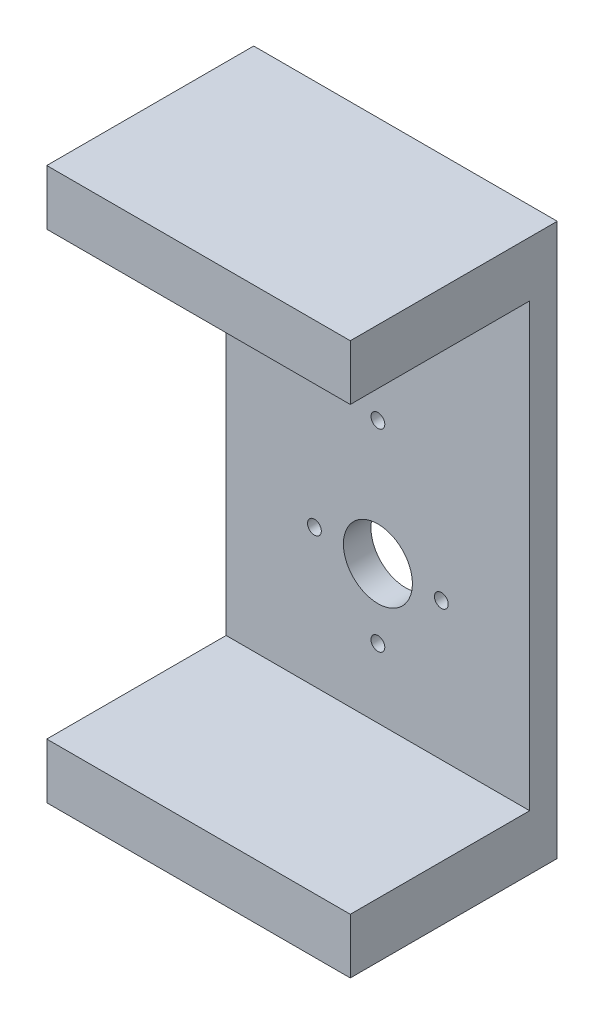
ISO-10303-21;
HEADER;
FILE_DESCRIPTION(('STEP AP214'),'2;1');
FILE_NAME('part.step','',(''),(''),'','','');
FILE_SCHEMA(('AUTOMOTIVE_DESIGN { 1 0 10303 214 1 1 1 1 }'));
ENDSEC;
DATA;
#1=APPLICATION_CONTEXT('core data for automotive mechanical design processes');
#2=APPLICATION_PROTOCOL_DEFINITION('international standard','automotive_design',2000,#1);
#3=PRODUCT_CONTEXT('',#1,'mechanical');
#4=PRODUCT('Part','Part','',(#3));
#5=PRODUCT_RELATED_PRODUCT_CATEGORY('part','',(#4));
#6=PRODUCT_DEFINITION_FORMATION('','',#4);
#7=PRODUCT_DEFINITION_CONTEXT('part definition',#1,'design');
#8=PRODUCT_DEFINITION('design','',#6,#7);
#9=PRODUCT_DEFINITION_SHAPE('','',#8);
#10=(LENGTH_UNIT() NAMED_UNIT(*) SI_UNIT(.MILLI.,.METRE.));
#11=(NAMED_UNIT(*) PLANE_ANGLE_UNIT() SI_UNIT($,.RADIAN.));
#12=(NAMED_UNIT(*) SI_UNIT($,.STERADIAN.) SOLID_ANGLE_UNIT());
#13=UNCERTAINTY_MEASURE_WITH_UNIT(LENGTH_MEASURE(1.E-05),#10,'distance_accuracy_value','');
#14=(GEOMETRIC_REPRESENTATION_CONTEXT(3) GLOBAL_UNCERTAINTY_ASSIGNED_CONTEXT((#13)) GLOBAL_UNIT_ASSIGNED_CONTEXT((#10,
#11,#12)) REPRESENTATION_CONTEXT('',''));
#15=CARTESIAN_POINT('',(0.,0.,0.));
#16=DIRECTION('',(0.,0.,1.));
#17=DIRECTION('',(1.,0.,0.));
#18=AXIS2_PLACEMENT_3D('',#15,#16,#17);
#19=CARTESIAN_POINT('',(0.,0.,10.));
#20=DIRECTION('',(0.,0.,-1.));
#21=DIRECTION('',(-1.,0.,0.));
#22=AXIS2_PLACEMENT_3D('',#19,#20,#21);
#23=PLANE('',#22);
#24=CARTESIAN_POINT('',(0.,15.,9.99999999999999));
#25=DIRECTION('',(0.,0.,-1.));
#26=DIRECTION('',(-1.,0.,0.));
#27=AXIS2_PLACEMENT_3D('',#24,#25,#26);
#28=CIRCLE('',#27,2.5);
#29=CARTESIAN_POINT('',(-2.5,15.,9.99999999999999));
#30=VERTEX_POINT('',#29);
#31=EDGE_CURVE('E337',#30,#30,#28,.T.);
#32=ORIENTED_EDGE('',*,*,#31,.T.);
#33=EDGE_LOOP('',(#32));
#34=FACE_BOUND('',#33,.T.);
#35=CARTESIAN_POINT('',(0.,-55.,9.99999999999999));
#36=DIRECTION('',(0.,0.,-1.));
#37=DIRECTION('',(-1.,0.,0.));
#38=AXIS2_PLACEMENT_3D('',#35,#36,#37);
#39=CIRCLE('',#38,2.5);
#40=CARTESIAN_POINT('',(-2.5,-55.,9.99999999999999));
#41=VERTEX_POINT('',#40);
#42=EDGE_CURVE('E340',#41,#41,#39,.T.);
#43=ORIENTED_EDGE('',*,*,#42,.T.);
#44=EDGE_LOOP('',(#43));
#45=FACE_BOUND('',#44,.T.);
#46=CARTESIAN_POINT('',(23.,-30.,9.99999999999999));
#47=DIRECTION('',(0.,0.,-1.));
#48=DIRECTION('',(-1.,0.,0.));
#49=AXIS2_PLACEMENT_3D('',#46,#47,#48);
#50=CIRCLE('',#49,2.5);
#51=CARTESIAN_POINT('',(20.5,-30.,9.99999999999999));
#52=VERTEX_POINT('',#51);
#53=EDGE_CURVE('E358',#52,#52,#50,.T.);
#54=ORIENTED_EDGE('',*,*,#53,.T.);
#55=EDGE_LOOP('',(#54));
#56=FACE_BOUND('',#55,.T.);
#57=CARTESIAN_POINT('',(-23.,-30.,9.99999999999999));
#58=DIRECTION('',(0.,0.,-1.));
#59=DIRECTION('',(-1.,0.,0.));
#60=AXIS2_PLACEMENT_3D('',#57,#58,#59);
#61=CIRCLE('',#60,2.5);
#62=CARTESIAN_POINT('',(-25.5,-30.,9.99999999999999));
#63=VERTEX_POINT('',#62);
#64=EDGE_CURVE('E353',#63,#63,#61,.T.);
#65=ORIENTED_EDGE('',*,*,#64,.T.);
#66=EDGE_LOOP('',(#65));
#67=FACE_BOUND('',#66,.T.);
#68=CARTESIAN_POINT('',(0.,-30.,9.99999999999999));
#69=DIRECTION('',(0.,0.,-1.));
#70=DIRECTION('',(-1.,0.,0.));
#71=AXIS2_PLACEMENT_3D('',#68,#69,#70);
#72=CIRCLE('',#71,12.5);
#73=CARTESIAN_POINT('',(-12.5,-30.,9.99999999999999));
#74=VERTEX_POINT('',#73);
#75=EDGE_CURVE('E150',#74,#74,#72,.T.);
#76=ORIENTED_EDGE('',*,*,#75,.T.);
#77=EDGE_LOOP('',(#76));
#78=FACE_BOUND('',#77,.T.);
#79=DIRECTION('',(1.,0.,0.));
#80=VECTOR('',#79,1.);
#81=CARTESIAN_POINT('',(-55.,80.,10.));
#82=LINE('',#81,#80);
#83=CARTESIAN_POINT('',(-55.,80.,10.));
#84=VERTEX_POINT('',#83);
#85=CARTESIAN_POINT('',(55.,80.,10.));
#86=VERTEX_POINT('',#85);
#87=EDGE_CURVE('E65',#84,#86,#82,.T.);
#88=ORIENTED_EDGE('',*,*,#87,.F.);
#89=DIRECTION('',(0.,-1.,0.));
#90=VECTOR('',#89,1.);
#91=CARTESIAN_POINT('',(-55.,-100.,10.));
#92=LINE('',#91,#90);
#93=CARTESIAN_POINT('',(-55.,-80.,10.));
#94=VERTEX_POINT('',#93);
#95=EDGE_CURVE('E133',#84,#94,#92,.T.);
#96=ORIENTED_EDGE('',*,*,#95,.T.);
#97=DIRECTION('',(-1.,0.,0.));
#98=VECTOR('',#97,1.);
#99=CARTESIAN_POINT('',(-55.,-80.,10.));
#100=LINE('',#99,#98);
#101=CARTESIAN_POINT('',(55.,-80.,10.));
#102=VERTEX_POINT('',#101);
#103=EDGE_CURVE('E60',#102,#94,#100,.T.);
#104=ORIENTED_EDGE('',*,*,#103,.F.);
#105=DIRECTION('',(0.,1.,0.));
#106=VECTOR('',#105,1.);
#107=CARTESIAN_POINT('',(55.,-100.,10.));
#108=LINE('',#107,#106);
#109=EDGE_CURVE('E171',#102,#86,#108,.T.);
#110=ORIENTED_EDGE('',*,*,#109,.T.);
#111=EDGE_LOOP('',(#88,#96,#104,#110));
#112=FACE_BOUND('',#111,.T.);
#113=ADVANCED_FACE('F44',(#34,#45,#56,#67,#78,#112),#23,.F.);
#114=CARTESIAN_POINT('',(55.,100.,10.));
#115=DIRECTION('',(0.,-1.,0.));
#116=DIRECTION('',(0.,0.,-1.));
#117=AXIS2_PLACEMENT_3D('',#114,#115,#116);
#118=PLANE('',#117);
#119=DIRECTION('',(-1.,0.,0.));
#120=VECTOR('',#119,1.);
#121=CARTESIAN_POINT('',(55.,100.,0.));
#122=LINE('',#121,#120);
#123=CARTESIAN_POINT('',(55.,100.,0.));
#124=VERTEX_POINT('',#123);
#125=CARTESIAN_POINT('',(-55.,100.,0.));
#126=VERTEX_POINT('',#125);
#127=EDGE_CURVE('E135',#124,#126,#122,.T.);
#128=ORIENTED_EDGE('',*,*,#127,.T.);
#129=DIRECTION('',(0.,0.,-1.));
#130=VECTOR('',#129,1.);
#131=CARTESIAN_POINT('',(-55.,100.,10.));
#132=LINE('',#131,#130);
#133=CARTESIAN_POINT('',(-55.,100.,75.));
#134=VERTEX_POINT('',#133);
#135=EDGE_CURVE('E11',#134,#126,#132,.T.);
#136=ORIENTED_EDGE('',*,*,#135,.F.);
#137=DIRECTION('',(-1.,0.,0.));
#138=VECTOR('',#137,1.);
#139=CARTESIAN_POINT('',(-55.,100.,75.));
#140=LINE('',#139,#138);
#141=CARTESIAN_POINT('',(55.,100.,75.));
#142=VERTEX_POINT('',#141);
#143=EDGE_CURVE('E127',#142,#134,#140,.T.);
#144=ORIENTED_EDGE('',*,*,#143,.F.);
#145=DIRECTION('',(0.,0.,-1.));
#146=VECTOR('',#145,1.);
#147=CARTESIAN_POINT('',(55.,100.,10.));
#148=LINE('',#147,#146);
#149=EDGE_CURVE('E174',#142,#124,#148,.T.);
#150=ORIENTED_EDGE('',*,*,#149,.T.);
#151=EDGE_LOOP('',(#128,#136,#144,#150));
#152=FACE_BOUND('',#151,.T.);
#153=ADVANCED_FACE('F46',(#152),#118,.F.);
#154=CARTESIAN_POINT('',(-55.,-100.,10.));
#155=DIRECTION('',(1.,0.,0.));
#156=DIRECTION('',(0.,0.,-1.));
#157=AXIS2_PLACEMENT_3D('',#154,#155,#156);
#158=PLANE('',#157);
#159=DIRECTION('',(0.,-1.,0.));
#160=VECTOR('',#159,1.);
#161=CARTESIAN_POINT('',(-55.,-100.,0.));
#162=LINE('',#161,#160);
#163=CARTESIAN_POINT('',(-55.,-100.,0.));
#164=VERTEX_POINT('',#163);
#165=EDGE_CURVE('E140',#126,#164,#162,.T.);
#166=ORIENTED_EDGE('',*,*,#165,.T.);
#167=DIRECTION('',(0.,0.,-1.));
#168=VECTOR('',#167,1.);
#169=CARTESIAN_POINT('',(-55.,-100.,10.));
#170=LINE('',#169,#168);
#171=CARTESIAN_POINT('',(-55.,-100.,75.));
#172=VERTEX_POINT('',#171);
#173=EDGE_CURVE('E53',#172,#164,#170,.T.);
#174=ORIENTED_EDGE('',*,*,#173,.F.);
#175=DIRECTION('',(0.,-1.,0.));
#176=VECTOR('',#175,1.);
#177=CARTESIAN_POINT('',(-55.,-100.,75.));
#178=LINE('',#177,#176);
#179=CARTESIAN_POINT('',(-55.,-80.,75.));
#180=VERTEX_POINT('',#179);
#181=EDGE_CURVE('E153',#180,#172,#178,.T.);
#182=ORIENTED_EDGE('',*,*,#181,.F.);
#183=DIRECTION('',(0.,0.,-1.));
#184=VECTOR('',#183,1.);
#185=CARTESIAN_POINT('',(-55.,-80.,75.));
#186=LINE('',#185,#184);
#187=EDGE_CURVE('E149',#180,#94,#186,.T.);
#188=ORIENTED_EDGE('',*,*,#187,.T.);
#189=ORIENTED_EDGE('',*,*,#95,.F.);
#190=DIRECTION('',(0.,0.,-1.));
#191=VECTOR('',#190,1.);
#192=CARTESIAN_POINT('',(-55.,80.,75.));
#193=LINE('',#192,#191);
#194=CARTESIAN_POINT('',(-55.,80.,75.));
#195=VERTEX_POINT('',#194);
#196=EDGE_CURVE('E113',#195,#84,#193,.T.);
#197=ORIENTED_EDGE('',*,*,#196,.F.);
#198=DIRECTION('',(0.,-1.,0.));
#199=VECTOR('',#198,1.);
#200=CARTESIAN_POINT('',(-55.,100.,75.));
#201=LINE('',#200,#199);
#202=EDGE_CURVE('E121',#134,#195,#201,.T.);
#203=ORIENTED_EDGE('',*,*,#202,.F.);
#204=ORIENTED_EDGE('',*,*,#135,.T.);
#205=EDGE_LOOP('',(#166,#174,#182,#188,#189,#197,#203,#204));
#206=FACE_BOUND('',#205,.T.);
#207=ADVANCED_FACE('F131',(#206),#158,.F.);
#208=CARTESIAN_POINT('',(55.,-100.,10.));
#209=DIRECTION('',(0.,1.,0.));
#210=DIRECTION('',(0.,0.,1.));
#211=AXIS2_PLACEMENT_3D('',#208,#209,#210);
#212=PLANE('',#211);
#213=DIRECTION('',(1.,0.,0.));
#214=VECTOR('',#213,1.);
#215=CARTESIAN_POINT('',(55.,-100.,0.));
#216=LINE('',#215,#214);
#217=CARTESIAN_POINT('',(55.,-100.,0.));
#218=VERTEX_POINT('',#217);
#219=EDGE_CURVE('E178',#164,#218,#216,.T.);
#220=ORIENTED_EDGE('',*,*,#219,.T.);
#221=DIRECTION('',(0.,0.,-1.));
#222=VECTOR('',#221,1.);
#223=CARTESIAN_POINT('',(55.,-100.,10.));
#224=LINE('',#223,#222);
#225=CARTESIAN_POINT('',(55.,-100.,75.));
#226=VERTEX_POINT('',#225);
#227=EDGE_CURVE('E186',#226,#218,#224,.T.);
#228=ORIENTED_EDGE('',*,*,#227,.F.);
#229=DIRECTION('',(1.,0.,0.));
#230=VECTOR('',#229,1.);
#231=CARTESIAN_POINT('',(-55.,-100.,75.));
#232=LINE('',#231,#230);
#233=EDGE_CURVE('E156',#172,#226,#232,.T.);
#234=ORIENTED_EDGE('',*,*,#233,.F.);
#235=ORIENTED_EDGE('',*,*,#173,.T.);
#236=EDGE_LOOP('',(#220,#228,#234,#235));
#237=FACE_BOUND('',#236,.T.);
#238=ADVANCED_FACE('F194',(#237),#212,.F.);
#239=CARTESIAN_POINT('',(55.,-100.,10.));
#240=DIRECTION('',(-1.,0.,0.));
#241=DIRECTION('',(0.,0.,1.));
#242=AXIS2_PLACEMENT_3D('',#239,#240,#241);
#243=PLANE('',#242);
#244=DIRECTION('',(0.,1.,0.));
#245=VECTOR('',#244,1.);
#246=CARTESIAN_POINT('',(55.,-100.,0.));
#247=LINE('',#246,#245);
#248=EDGE_CURVE('E172',#218,#124,#247,.T.);
#249=ORIENTED_EDGE('',*,*,#248,.T.);
#250=ORIENTED_EDGE('',*,*,#149,.F.);
#251=DIRECTION('',(0.,1.,0.));
#252=VECTOR('',#251,1.);
#253=CARTESIAN_POINT('',(55.,100.,75.));
#254=LINE('',#253,#252);
#255=CARTESIAN_POINT('',(55.,80.,75.));
#256=VERTEX_POINT('',#255);
#257=EDGE_CURVE('E120',#256,#142,#254,.T.);
#258=ORIENTED_EDGE('',*,*,#257,.F.);
#259=DIRECTION('',(0.,0.,-1.));
#260=VECTOR('',#259,1.);
#261=CARTESIAN_POINT('',(55.,80.,75.));
#262=LINE('',#261,#260);
#263=EDGE_CURVE('E115',#256,#86,#262,.T.);
#264=ORIENTED_EDGE('',*,*,#263,.T.);
#265=ORIENTED_EDGE('',*,*,#109,.F.);
#266=DIRECTION('',(0.,0.,-1.));
#267=VECTOR('',#266,1.);
#268=CARTESIAN_POINT('',(55.,-80.,75.));
#269=LINE('',#268,#267);
#270=CARTESIAN_POINT('',(55.,-80.,75.));
#271=VERTEX_POINT('',#270);
#272=EDGE_CURVE('E145',#271,#102,#269,.T.);
#273=ORIENTED_EDGE('',*,*,#272,.F.);
#274=DIRECTION('',(0.,1.,0.));
#275=VECTOR('',#274,1.);
#276=CARTESIAN_POINT('',(55.,-100.,75.));
#277=LINE('',#276,#275);
#278=EDGE_CURVE('E163',#226,#271,#277,.T.);
#279=ORIENTED_EDGE('',*,*,#278,.F.);
#280=ORIENTED_EDGE('',*,*,#227,.T.);
#281=EDGE_LOOP('',(#249,#250,#258,#264,#265,#273,#279,#280));
#282=FACE_BOUND('',#281,.T.);
#283=ADVANCED_FACE('F201',(#282),#243,.F.);
#284=CARTESIAN_POINT('',(0.,0.,0.));
#285=DIRECTION('',(0.,0.,-1.));
#286=DIRECTION('',(-1.,0.,0.));
#287=AXIS2_PLACEMENT_3D('',#284,#285,#286);
#288=PLANE('',#287);
#289=CARTESIAN_POINT('',(0.,15.,0.));
#290=DIRECTION('',(0.,0.,-1.));
#291=DIRECTION('',(-1.,0.,0.));
#292=AXIS2_PLACEMENT_3D('',#289,#290,#291);
#293=CIRCLE('',#292,2.5);
#294=CARTESIAN_POINT('',(-2.5,15.,0.));
#295=VERTEX_POINT('',#294);
#296=EDGE_CURVE('E335',#295,#295,#293,.T.);
#297=ORIENTED_EDGE('',*,*,#296,.F.);
#298=EDGE_LOOP('',(#297));
#299=FACE_BOUND('',#298,.T.);
#300=CARTESIAN_POINT('',(0.,-55.,0.));
#301=DIRECTION('',(0.,0.,-1.));
#302=DIRECTION('',(-1.,0.,0.));
#303=AXIS2_PLACEMENT_3D('',#300,#301,#302);
#304=CIRCLE('',#303,2.5);
#305=CARTESIAN_POINT('',(-2.5,-55.,0.));
#306=VERTEX_POINT('',#305);
#307=EDGE_CURVE('E383',#306,#306,#304,.T.);
#308=ORIENTED_EDGE('',*,*,#307,.F.);
#309=EDGE_LOOP('',(#308));
#310=FACE_BOUND('',#309,.T.);
#311=CARTESIAN_POINT('',(23.,-30.,0.));
#312=DIRECTION('',(0.,0.,-1.));
#313=DIRECTION('',(-1.,0.,0.));
#314=AXIS2_PLACEMENT_3D('',#311,#312,#313);
#315=CIRCLE('',#314,2.5);
#316=CARTESIAN_POINT('',(20.5,-30.,0.));
#317=VERTEX_POINT('',#316);
#318=EDGE_CURVE('E345',#317,#317,#315,.T.);
#319=ORIENTED_EDGE('',*,*,#318,.F.);
#320=EDGE_LOOP('',(#319));
#321=FACE_BOUND('',#320,.T.);
#322=CARTESIAN_POINT('',(-23.,-30.,0.));
#323=DIRECTION('',(0.,0.,-1.));
#324=DIRECTION('',(-1.,0.,0.));
#325=AXIS2_PLACEMENT_3D('',#322,#323,#324);
#326=CIRCLE('',#325,2.5);
#327=CARTESIAN_POINT('',(-25.5,-30.,0.));
#328=VERTEX_POINT('',#327);
#329=EDGE_CURVE('E339',#328,#328,#326,.T.);
#330=ORIENTED_EDGE('',*,*,#329,.F.);
#331=EDGE_LOOP('',(#330));
#332=FACE_BOUND('',#331,.T.);
#333=CARTESIAN_POINT('',(0.,-30.,0.));
#334=DIRECTION('',(0.,0.,-1.));
#335=DIRECTION('',(-1.,0.,0.));
#336=AXIS2_PLACEMENT_3D('',#333,#334,#335);
#337=CIRCLE('',#336,12.5);
#338=CARTESIAN_POINT('',(-12.5,-30.,0.));
#339=VERTEX_POINT('',#338);
#340=EDGE_CURVE('E362',#339,#339,#337,.T.);
#341=ORIENTED_EDGE('',*,*,#340,.F.);
#342=EDGE_LOOP('',(#341));
#343=FACE_BOUND('',#342,.T.);
#344=ORIENTED_EDGE('',*,*,#127,.F.);
#345=ORIENTED_EDGE('',*,*,#248,.F.);
#346=ORIENTED_EDGE('',*,*,#219,.F.);
#347=ORIENTED_EDGE('',*,*,#165,.F.);
#348=EDGE_LOOP('',(#344,#345,#346,#347));
#349=FACE_BOUND('',#348,.T.);
#350=ADVANCED_FACE('F199',(#299,#310,#321,#332,#343,#349),#288,.T.);
#351=CARTESIAN_POINT('',(-55.,-80.,75.));
#352=DIRECTION('',(0.,-1.,0.));
#353=DIRECTION('',(0.,0.,-1.));
#354=AXIS2_PLACEMENT_3D('',#351,#352,#353);
#355=PLANE('',#354);
#356=ORIENTED_EDGE('',*,*,#103,.T.);
#357=ORIENTED_EDGE('',*,*,#187,.F.);
#358=DIRECTION('',(-1.,0.,0.));
#359=VECTOR('',#358,1.);
#360=CARTESIAN_POINT('',(-55.,-80.,75.));
#361=LINE('',#360,#359);
#362=EDGE_CURVE('E160',#271,#180,#361,.T.);
#363=ORIENTED_EDGE('',*,*,#362,.F.);
#364=ORIENTED_EDGE('',*,*,#272,.T.);
#365=EDGE_LOOP('',(#356,#357,#363,#364));
#366=FACE_BOUND('',#365,.T.);
#367=ADVANCED_FACE('F212',(#366),#355,.F.);
#368=CARTESIAN_POINT('',(0.,0.,75.));
#369=DIRECTION('',(0.,0.,1.));
#370=DIRECTION('',(1.,0.,0.));
#371=AXIS2_PLACEMENT_3D('',#368,#369,#370);
#372=PLANE('',#371);
#373=ORIENTED_EDGE('',*,*,#233,.T.);
#374=ORIENTED_EDGE('',*,*,#278,.T.);
#375=ORIENTED_EDGE('',*,*,#362,.T.);
#376=ORIENTED_EDGE('',*,*,#181,.T.);
#377=EDGE_LOOP('',(#373,#374,#375,#376));
#378=FACE_BOUND('',#377,.T.);
#379=ADVANCED_FACE('F215',(#378),#372,.T.);
#380=CARTESIAN_POINT('',(-55.,80.,75.));
#381=DIRECTION('',(0.,1.,0.));
#382=DIRECTION('',(0.,0.,1.));
#383=AXIS2_PLACEMENT_3D('',#380,#381,#382);
#384=PLANE('',#383);
#385=ORIENTED_EDGE('',*,*,#87,.T.);
#386=ORIENTED_EDGE('',*,*,#263,.F.);
#387=DIRECTION('',(1.,0.,0.));
#388=VECTOR('',#387,1.);
#389=CARTESIAN_POINT('',(-55.,80.,75.));
#390=LINE('',#389,#388);
#391=EDGE_CURVE('E109',#195,#256,#390,.T.);
#392=ORIENTED_EDGE('',*,*,#391,.F.);
#393=ORIENTED_EDGE('',*,*,#196,.T.);
#394=EDGE_LOOP('',(#385,#386,#392,#393));
#395=FACE_BOUND('',#394,.T.);
#396=ADVANCED_FACE('F111',(#395),#384,.F.);
#397=CARTESIAN_POINT('',(0.,0.,75.));
#398=DIRECTION('',(0.,0.,1.));
#399=DIRECTION('',(1.,0.,0.));
#400=AXIS2_PLACEMENT_3D('',#397,#398,#399);
#401=PLANE('',#400);
#402=ORIENTED_EDGE('',*,*,#202,.T.);
#403=ORIENTED_EDGE('',*,*,#391,.T.);
#404=ORIENTED_EDGE('',*,*,#257,.T.);
#405=ORIENTED_EDGE('',*,*,#143,.T.);
#406=EDGE_LOOP('',(#402,#403,#404,#405));
#407=FACE_BOUND('',#406,.T.);
#408=ADVANCED_FACE('F125',(#407),#401,.T.);
#409=CARTESIAN_POINT('',(0.,-30.,75.));
#410=DIRECTION('',(0.,0.,-1.));
#411=DIRECTION('',(-1.,0.,0.));
#412=AXIS2_PLACEMENT_3D('',#409,#410,#411);
#413=CYLINDRICAL_SURFACE('',#412,12.5);
#414=ORIENTED_EDGE('',*,*,#340,.T.);
#415=EDGE_LOOP('',(#414));
#416=FACE_BOUND('',#415,.T.);
#417=ORIENTED_EDGE('',*,*,#75,.F.);
#418=EDGE_LOOP('',(#417));
#419=FACE_BOUND('',#418,.T.);
#420=ADVANCED_FACE('F281',(#416,#419),#413,.F.);
#421=CARTESIAN_POINT('',(-23.,-30.,75.));
#422=DIRECTION('',(0.,0.,-1.));
#423=DIRECTION('',(-1.,0.,0.));
#424=AXIS2_PLACEMENT_3D('',#421,#422,#423);
#425=CYLINDRICAL_SURFACE('',#424,2.5);
#426=ORIENTED_EDGE('',*,*,#329,.T.);
#427=EDGE_LOOP('',(#426));
#428=FACE_BOUND('',#427,.T.);
#429=ORIENTED_EDGE('',*,*,#64,.F.);
#430=EDGE_LOOP('',(#429));
#431=FACE_BOUND('',#430,.T.);
#432=ADVANCED_FACE('F290',(#428,#431),#425,.F.);
#433=CARTESIAN_POINT('',(23.,-30.,75.));
#434=DIRECTION('',(0.,0.,-1.));
#435=DIRECTION('',(-1.,0.,0.));
#436=AXIS2_PLACEMENT_3D('',#433,#434,#435);
#437=CYLINDRICAL_SURFACE('',#436,2.5);
#438=ORIENTED_EDGE('',*,*,#318,.T.);
#439=EDGE_LOOP('',(#438));
#440=FACE_BOUND('',#439,.T.);
#441=ORIENTED_EDGE('',*,*,#53,.F.);
#442=EDGE_LOOP('',(#441));
#443=FACE_BOUND('',#442,.T.);
#444=ADVANCED_FACE('F300',(#440,#443),#437,.F.);
#445=CARTESIAN_POINT('',(0.,-55.,75.));
#446=DIRECTION('',(0.,0.,-1.));
#447=DIRECTION('',(-1.,0.,0.));
#448=AXIS2_PLACEMENT_3D('',#445,#446,#447);
#449=CYLINDRICAL_SURFACE('',#448,2.5);
#450=ORIENTED_EDGE('',*,*,#307,.T.);
#451=EDGE_LOOP('',(#450));
#452=FACE_BOUND('',#451,.T.);
#453=ORIENTED_EDGE('',*,*,#42,.F.);
#454=EDGE_LOOP('',(#453));
#455=FACE_BOUND('',#454,.T.);
#456=ADVANCED_FACE('F309',(#452,#455),#449,.F.);
#457=CARTESIAN_POINT('',(0.,15.,75.));
#458=DIRECTION('',(0.,0.,-1.));
#459=DIRECTION('',(-1.,0.,0.));
#460=AXIS2_PLACEMENT_3D('',#457,#458,#459);
#461=CYLINDRICAL_SURFACE('',#460,2.5);
#462=ORIENTED_EDGE('',*,*,#296,.T.);
#463=EDGE_LOOP('',(#462));
#464=FACE_BOUND('',#463,.T.);
#465=ORIENTED_EDGE('',*,*,#31,.F.);
#466=EDGE_LOOP('',(#465));
#467=FACE_BOUND('',#466,.T.);
#468=ADVANCED_FACE('F319',(#464,#467),#461,.F.);
#469=CLOSED_SHELL('',(#113,#153,#207,#238,#283,#350,#367,#379,#396,#408,#420,#432,#444,#456,#468));
#470=MANIFOLD_SOLID_BREP('B2',#469);
#471=ADVANCED_BREP_SHAPE_REPRESENTATION('',(#18,#470),#14);
#472=SHAPE_DEFINITION_REPRESENTATION(#9,#471);
ENDSEC;
END-ISO-10303-21;
